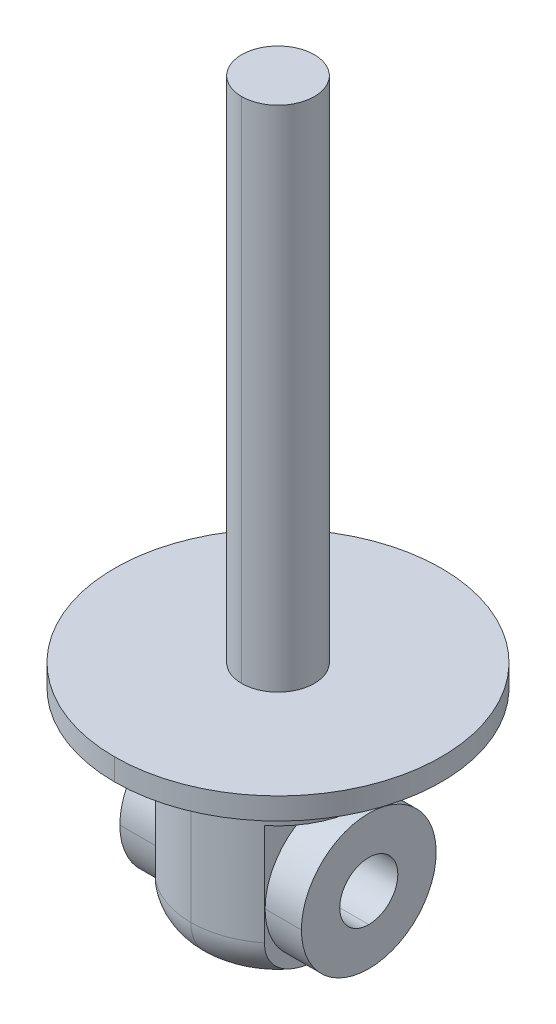
ISO-10303-21;
HEADER;
FILE_DESCRIPTION(('STEP AP214'),'2;1');
FILE_NAME('part.step','',(''),(''),'','','');
FILE_SCHEMA(('AUTOMOTIVE_DESIGN { 1 0 10303 214 1 1 1 1 }'));
ENDSEC;
DATA;
#1=APPLICATION_CONTEXT('core data for automotive mechanical design processes');
#2=APPLICATION_PROTOCOL_DEFINITION('international standard','automotive_design',2000,#1);
#3=PRODUCT_CONTEXT('',#1,'mechanical');
#4=PRODUCT('Part','Part','',(#3));
#5=PRODUCT_RELATED_PRODUCT_CATEGORY('part','',(#4));
#6=PRODUCT_DEFINITION_FORMATION('','',#4);
#7=PRODUCT_DEFINITION_CONTEXT('part definition',#1,'design');
#8=PRODUCT_DEFINITION('design','',#6,#7);
#9=PRODUCT_DEFINITION_SHAPE('','',#8);
#10=(LENGTH_UNIT() NAMED_UNIT(*) SI_UNIT(.MILLI.,.METRE.));
#11=(NAMED_UNIT(*) PLANE_ANGLE_UNIT() SI_UNIT($,.RADIAN.));
#12=(NAMED_UNIT(*) SI_UNIT($,.STERADIAN.) SOLID_ANGLE_UNIT());
#13=UNCERTAINTY_MEASURE_WITH_UNIT(LENGTH_MEASURE(1.E-05),#10,'distance_accuracy_value','');
#14=(GEOMETRIC_REPRESENTATION_CONTEXT(3) GLOBAL_UNCERTAINTY_ASSIGNED_CONTEXT((#13)) GLOBAL_UNIT_ASSIGNED_CONTEXT((#10,
#11,#12)) REPRESENTATION_CONTEXT('',''));
#15=CARTESIAN_POINT('',(0.,0.,0.));
#16=DIRECTION('',(0.,0.,1.));
#17=DIRECTION('',(1.,0.,0.));
#18=AXIS2_PLACEMENT_3D('',#15,#16,#17);
#19=CARTESIAN_POINT('',(12.5,-18.,0.));
#20=DIRECTION('',(1.,0.,0.));
#21=DIRECTION('',(0.,1.,0.));
#22=AXIS2_PLACEMENT_3D('',#19,#20,#21);
#23=PLANE('',#22);
#24=CARTESIAN_POINT('',(12.5,-18.,0.));
#25=DIRECTION('',(1.,0.,0.));
#26=DIRECTION('',(0.,0.,-1.));
#27=AXIS2_PLACEMENT_3D('',#24,#25,#26);
#28=CIRCLE('',#27,4.);
#29=CARTESIAN_POINT('',(12.5,-14.,0.));
#30=VERTEX_POINT('',#29);
#31=CARTESIAN_POINT('',(12.5,-22.,0.));
#32=VERTEX_POINT('',#31);
#33=EDGE_CURVE('E33',#30,#32,#28,.T.);
#34=ORIENTED_EDGE('',*,*,#33,.F.);
#35=CARTESIAN_POINT('',(12.5,-18.,0.));
#36=DIRECTION('',(1.,0.,0.));
#37=DIRECTION('',(0.,0.,-1.));
#38=AXIS2_PLACEMENT_3D('',#35,#36,#37);
#39=CIRCLE('',#38,4.);
#40=EDGE_CURVE('E342',#32,#30,#39,.T.);
#41=ORIENTED_EDGE('',*,*,#40,.F.);
#42=EDGE_LOOP('',(#34,#41));
#43=FACE_BOUND('',#42,.T.);
#44=CARTESIAN_POINT('',(12.5,-18.,0.));
#45=DIRECTION('',(1.,0.,0.));
#46=DIRECTION('',(0.,0.,-1.));
#47=AXIS2_PLACEMENT_3D('',#44,#45,#46);
#48=CIRCLE('',#47,9.27822291982509);
#49=CARTESIAN_POINT('',(12.5,-18.,9.27822291982508));
#50=VERTEX_POINT('',#49);
#51=CARTESIAN_POINT('',(12.5,-18.,-9.27822291982509));
#52=VERTEX_POINT('',#51);
#53=EDGE_CURVE('E10',#50,#52,#48,.T.);
#54=ORIENTED_EDGE('',*,*,#53,.T.);
#55=CARTESIAN_POINT('',(12.5,-18.,0.));
#56=DIRECTION('',(1.,0.,0.));
#57=DIRECTION('',(0.,0.,-1.));
#58=AXIS2_PLACEMENT_3D('',#55,#56,#57);
#59=CIRCLE('',#58,9.27822291982509);
#60=EDGE_CURVE('E394',#52,#50,#59,.T.);
#61=ORIENTED_EDGE('',*,*,#60,.T.);
#62=EDGE_LOOP('',(#54,#61));
#63=FACE_BOUND('',#62,.T.);
#64=ADVANCED_FACE('F15',(#43,#63),#23,.T.);
#65=CARTESIAN_POINT('',(12.5,-18.,0.));
#66=DIRECTION('',(-1.,0.,0.));
#67=DIRECTION('',(0.,0.,1.));
#68=AXIS2_PLACEMENT_3D('',#65,#66,#67);
#69=CYLINDRICAL_SURFACE('',#68,9.27822291982509);
#70=DIRECTION('',(-1.,0.,0.));
#71=VECTOR('',#70,1.);
#72=CARTESIAN_POINT('',(12.5,-18.,-9.27822291982509));
#73=LINE('',#72,#71);
#74=CARTESIAN_POINT('',(7.5,-18.,-9.27822291982509));
#75=VERTEX_POINT('',#74);
#76=EDGE_CURVE('E347',#52,#75,#73,.T.);
#77=ORIENTED_EDGE('',*,*,#76,.F.);
#78=ORIENTED_EDGE('',*,*,#53,.F.);
#79=DIRECTION('',(-1.,0.,0.));
#80=VECTOR('',#79,1.);
#81=CARTESIAN_POINT('',(12.5,-18.,9.27822291982508));
#82=LINE('',#81,#80);
#83=CARTESIAN_POINT('',(7.5,-18.,9.27822291982508));
#84=VERTEX_POINT('',#83);
#85=EDGE_CURVE('E336',#50,#84,#82,.T.);
#86=ORIENTED_EDGE('',*,*,#85,.T.);
#87=CARTESIAN_POINT('',(7.5,-18.,0.));
#88=DIRECTION('',(1.,0.,0.));
#89=DIRECTION('',(0.,-1.,0.));
#90=AXIS2_PLACEMENT_3D('',#87,#88,#89);
#91=CIRCLE('',#90,9.27822291982509);
#92=EDGE_CURVE('E221',#84,#75,#91,.T.);
#93=ORIENTED_EDGE('',*,*,#92,.T.);
#94=EDGE_LOOP('',(#77,#78,#86,#93));
#95=FACE_BOUND('',#94,.T.);
#96=ADVANCED_FACE('F250',(#95),#69,.T.);
#97=CARTESIAN_POINT('',(-20.5,-18.,0.));
#98=DIRECTION('',(1.,0.,0.));
#99=DIRECTION('',(0.,1.,0.));
#100=AXIS2_PLACEMENT_3D('',#97,#98,#99);
#101=CYLINDRICAL_SURFACE('',#100,4.);
#102=DIRECTION('',(1.,0.,0.));
#103=VECTOR('',#102,1.);
#104=CARTESIAN_POINT('',(-20.5,-22.,0.));
#105=LINE('',#104,#103);
#106=CARTESIAN_POINT('',(-12.5,-22.,0.));
#107=VERTEX_POINT('',#106);
#108=EDGE_CURVE('E335',#107,#32,#105,.T.);
#109=ORIENTED_EDGE('',*,*,#108,.F.);
#110=CARTESIAN_POINT('',(-12.5,-18.,0.));
#111=DIRECTION('',(1.,0.,0.));
#112=DIRECTION('',(0.,0.,-1.));
#113=AXIS2_PLACEMENT_3D('',#110,#111,#112);
#114=CIRCLE('',#113,4.);
#115=CARTESIAN_POINT('',(-12.5,-14.,0.));
#116=VERTEX_POINT('',#115);
#117=EDGE_CURVE('E321',#116,#107,#114,.T.);
#118=ORIENTED_EDGE('',*,*,#117,.F.);
#119=DIRECTION('',(1.,0.,0.));
#120=VECTOR('',#119,1.);
#121=CARTESIAN_POINT('',(-20.5,-14.,0.));
#122=LINE('',#121,#120);
#123=EDGE_CURVE('E337',#116,#30,#122,.T.);
#124=ORIENTED_EDGE('',*,*,#123,.T.);
#125=ORIENTED_EDGE('',*,*,#33,.T.);
#126=EDGE_LOOP('',(#109,#118,#124,#125));
#127=FACE_BOUND('',#126,.T.);
#128=ADVANCED_FACE('F258',(#127),#101,.F.);
#129=CARTESIAN_POINT('',(-12.5,-18.,0.));
#130=DIRECTION('',(1.,0.,0.));
#131=DIRECTION('',(0.,1.,0.));
#132=AXIS2_PLACEMENT_3D('',#129,#130,#131);
#133=PLANE('',#132);
#134=ORIENTED_EDGE('',*,*,#117,.T.);
#135=CARTESIAN_POINT('',(-12.5,-18.,0.));
#136=DIRECTION('',(1.,0.,0.));
#137=DIRECTION('',(0.,0.,-1.));
#138=AXIS2_PLACEMENT_3D('',#135,#136,#137);
#139=CIRCLE('',#138,4.);
#140=EDGE_CURVE('E331',#107,#116,#139,.T.);
#141=ORIENTED_EDGE('',*,*,#140,.T.);
#142=EDGE_LOOP('',(#134,#141));
#143=FACE_BOUND('',#142,.T.);
#144=CARTESIAN_POINT('',(-12.5,-18.,0.));
#145=DIRECTION('',(1.,0.,0.));
#146=DIRECTION('',(0.,0.,-1.));
#147=AXIS2_PLACEMENT_3D('',#144,#145,#146);
#148=CIRCLE('',#147,9.27822291982509);
#149=CARTESIAN_POINT('',(-12.5,-18.,9.27822291982508));
#150=VERTEX_POINT('',#149);
#151=CARTESIAN_POINT('',(-12.5,-18.,-9.27822291982509));
#152=VERTEX_POINT('',#151);
#153=EDGE_CURVE('E325',#150,#152,#148,.T.);
#154=ORIENTED_EDGE('',*,*,#153,.F.);
#155=CARTESIAN_POINT('',(-12.5,-18.,0.));
#156=DIRECTION('',(1.,0.,0.));
#157=DIRECTION('',(0.,0.,-1.));
#158=AXIS2_PLACEMENT_3D('',#155,#156,#157);
#159=CIRCLE('',#158,9.27822291982509);
#160=EDGE_CURVE('E201',#152,#150,#159,.T.);
#161=ORIENTED_EDGE('',*,*,#160,.F.);
#162=EDGE_LOOP('',(#154,#161));
#163=FACE_BOUND('',#162,.T.);
#164=ADVANCED_FACE('F256',(#143,#163),#133,.F.);
#165=CARTESIAN_POINT('',(12.5,-18.,0.));
#166=DIRECTION('',(-1.,0.,0.));
#167=DIRECTION('',(0.,0.,1.));
#168=AXIS2_PLACEMENT_3D('',#165,#166,#167);
#169=CYLINDRICAL_SURFACE('',#168,9.27822291982509);
#170=DIRECTION('',(-1.,0.,0.));
#171=VECTOR('',#170,1.);
#172=CARTESIAN_POINT('',(12.5,-18.,-9.27822291982509));
#173=LINE('',#172,#171);
#174=CARTESIAN_POINT('',(-7.5,-18.,-9.27822291982509));
#175=VERTEX_POINT('',#174);
#176=EDGE_CURVE('E350',#175,#152,#173,.T.);
#177=ORIENTED_EDGE('',*,*,#176,.F.);
#178=CARTESIAN_POINT('',(-7.5,-18.,0.));
#179=DIRECTION('',(-1.,0.,0.));
#180=DIRECTION('',(0.,1.,0.));
#181=AXIS2_PLACEMENT_3D('',#178,#179,#180);
#182=CIRCLE('',#181,9.27822291982509);
#183=CARTESIAN_POINT('',(-7.5,-18.,9.27822291982508));
#184=VERTEX_POINT('',#183);
#185=EDGE_CURVE('E312',#175,#184,#182,.T.);
#186=ORIENTED_EDGE('',*,*,#185,.T.);
#187=DIRECTION('',(-1.,0.,0.));
#188=VECTOR('',#187,1.);
#189=CARTESIAN_POINT('',(12.5,-18.,9.27822291982508));
#190=LINE('',#189,#188);
#191=EDGE_CURVE('E191',#184,#150,#190,.T.);
#192=ORIENTED_EDGE('',*,*,#191,.T.);
#193=ORIENTED_EDGE('',*,*,#153,.T.);
#194=EDGE_LOOP('',(#177,#186,#192,#193));
#195=FACE_BOUND('',#194,.T.);
#196=ADVANCED_FACE('F238',(#195),#169,.T.);
#197=CARTESIAN_POINT('',(-27.5,-8.,-22.5));
#198=DIRECTION('',(0.,1.,0.));
#199=DIRECTION('',(1.,0.,0.));
#200=AXIS2_PLACEMENT_3D('',#197,#198,#199);
#201=PLANE('',#200);
#202=DIRECTION('',(0.,0.,1.));
#203=VECTOR('',#202,1.);
#204=CARTESIAN_POINT('',(-7.5,-8.,-22.5));
#205=LINE('',#204,#203);
#206=CARTESIAN_POINT('',(-7.5,-8.,-9.36749699759761));
#207=VERTEX_POINT('',#206);
#208=CARTESIAN_POINT('',(-7.5,-8.,9.36749699759759));
#209=VERTEX_POINT('',#208);
#210=EDGE_CURVE('E386',#207,#209,#205,.T.);
#211=ORIENTED_EDGE('',*,*,#210,.T.);
#212=CARTESIAN_POINT('',(0.,-8.,0.));
#213=DIRECTION('',(0.,1.,0.));
#214=DIRECTION('',(-1.,0.,0.));
#215=AXIS2_PLACEMENT_3D('',#212,#213,#214);
#216=CIRCLE('',#215,12.);
#217=EDGE_CURVE('E47',#207,#209,#216,.T.);
#218=ORIENTED_EDGE('',*,*,#217,.F.);
#219=EDGE_LOOP('',(#211,#218));
#220=FACE_BOUND('',#219,.T.);
#221=ADVANCED_FACE('F234',(#220),#201,.F.);
#222=CARTESIAN_POINT('',(27.5,-8.,-22.5));
#223=DIRECTION('',(0.,1.,0.));
#224=DIRECTION('',(1.,0.,0.));
#225=AXIS2_PLACEMENT_3D('',#222,#223,#224);
#226=PLANE('',#225);
#227=DIRECTION('',(0.,0.,1.));
#228=VECTOR('',#227,1.);
#229=CARTESIAN_POINT('',(7.5,-8.,-22.5));
#230=LINE('',#229,#228);
#231=CARTESIAN_POINT('',(7.5,-8.,-9.3674969975976));
#232=VERTEX_POINT('',#231);
#233=CARTESIAN_POINT('',(7.5,-8.,9.3674969975976));
#234=VERTEX_POINT('',#233);
#235=EDGE_CURVE('E165',#232,#234,#230,.T.);
#236=ORIENTED_EDGE('',*,*,#235,.F.);
#237=CARTESIAN_POINT('',(0.,-8.,0.));
#238=DIRECTION('',(0.,1.,0.));
#239=DIRECTION('',(-1.,0.,0.));
#240=AXIS2_PLACEMENT_3D('',#237,#238,#239);
#241=CIRCLE('',#240,12.);
#242=EDGE_CURVE('E171',#234,#232,#241,.T.);
#243=ORIENTED_EDGE('',*,*,#242,.F.);
#244=EDGE_LOOP('',(#236,#243));
#245=FACE_BOUND('',#244,.T.);
#246=ADVANCED_FACE('F228',(#245),#226,.F.);
#247=CARTESIAN_POINT('',(0.,-22.,0.));
#248=DIRECTION('',(0.,-1.,0.));
#249=DIRECTION('',(0.,0.,-1.));
#250=AXIS2_PLACEMENT_3D('',#247,#248,#249);
#251=DEGENERATE_TOROIDAL_SURFACE('',#250,6.,6.,.T.);
#252=CARTESIAN_POINT('',(0.,-22.,6.));
#253=DIRECTION('',(1.,0.,0.));
#254=DIRECTION('',(0.,0.,-1.));
#255=AXIS2_PLACEMENT_3D('',#252,#253,#254);
#256=CIRCLE('',#255,6.);
#257=CARTESIAN_POINT('',(0.,-22.,12.));
#258=VERTEX_POINT('',#257);
#259=CARTESIAN_POINT('',(0.,-28.,6.));
#260=VERTEX_POINT('',#259);
#261=EDGE_CURVE('E190',#258,#260,#256,.T.);
#262=ORIENTED_EDGE('',*,*,#261,.F.);
#263=CARTESIAN_POINT('',(0.,-22.,0.));
#264=DIRECTION('',(0.,1.,0.));
#265=DIRECTION('',(0.,0.,-1.));
#266=AXIS2_PLACEMENT_3D('',#263,#264,#265);
#267=CIRCLE('',#266,12.);
#268=CARTESIAN_POINT('',(-7.5,-22.,9.3674969975976));
#269=VERTEX_POINT('',#268);
#270=EDGE_CURVE('E384',#269,#258,#267,.T.);
#271=ORIENTED_EDGE('',*,*,#270,.F.);
#272=CARTESIAN_POINT('',(-7.5,-22.,-9.3674969975976));
#273=CARTESIAN_POINT('',(-7.5,-22.1379254134121,-9.36752360059183));
#274=CARTESIAN_POINT('',(-7.5,-22.2758424204656,-9.36140588140784));
#275=CARTESIAN_POINT('',(-7.5,-22.550567682157,-9.33707750948176));
#276=CARTESIAN_POINT('',(-7.5,-22.687376240306,-9.31887028868478));
#277=CARTESIAN_POINT('',(-7.5,-22.9582958946312,-9.27066096029671));
#278=CARTESIAN_POINT('',(-7.5,-23.0924159761173,-9.24070924914176));
#279=CARTESIAN_POINT('',(-7.5,-23.3575801130501,-9.16937353046772));
#280=CARTESIAN_POINT('',(-7.5,-23.4886240768744,-9.12798918289375));
#281=CARTESIAN_POINT('',(-7.5,-23.7466218966691,-9.03430487179111));
#282=CARTESIAN_POINT('',(-7.5,-23.8735790248543,-8.98201390514934));
#283=CARTESIAN_POINT('',(-7.5,-24.1227575760699,-8.86705796751639));
#284=CARTESIAN_POINT('',(-7.5,-24.2449771613871,-8.80438901958829));
#285=CARTESIAN_POINT('',(-7.5,-24.4839677765168,-8.66933878779964));
#286=CARTESIAN_POINT('',(-7.5,-24.600737113538,-8.59695451315764));
#287=CARTESIAN_POINT('',(-7.5,-24.8282482206916,-8.44319283050263));
#288=CARTESIAN_POINT('',(-7.5,-24.9389877097997,-8.36181205400793));
#289=CARTESIAN_POINT('',(-7.5,-25.1579144187622,-8.18768643874841));
#290=CARTESIAN_POINT('',(-7.5,-25.2658555443986,-8.0946325111893));
#291=CARTESIAN_POINT('',(-7.5,-25.4743801275468,-7.90055755028191));
#292=CARTESIAN_POINT('',(-7.5,-25.574960718531,-7.79953344447683));
#293=CARTESIAN_POINT('',(-7.5,-25.7684584054089,-7.59046390999482));
#294=CARTESIAN_POINT('',(-7.5,-25.8613778354865,-7.48242063797192));
#295=CARTESIAN_POINT('',(-7.5,-26.0394979594376,-7.26013734848887));
#296=CARTESIAN_POINT('',(-7.5,-26.1246970382165,-7.14589604235709));
#297=CARTESIAN_POINT('',(-7.5,-26.3256362297516,-6.85704785260765));
#298=CARTESIAN_POINT('',(-7.5,-26.436902438093,-6.67931237369057));
#299=CARTESIAN_POINT('',(-7.5,-26.6432107364478,-6.31464956725694));
#300=CARTESIAN_POINT('',(-7.5,-26.7382457590837,-6.12771828110244));
#301=CARTESIAN_POINT('',(-7.5,-26.9130469720023,-5.74657680556301));
#302=CARTESIAN_POINT('',(-7.5,-26.9927921722833,-5.55235704142313));
#303=CARTESIAN_POINT('',(-7.5,-27.1380510486321,-5.15863813842682));
#304=CARTESIAN_POINT('',(-7.5,-27.2035584073192,-4.95913669993503));
#305=CARTESIAN_POINT('',(-7.5,-27.3908167563932,-4.32075112994489));
#306=CARTESIAN_POINT('',(-7.5,-27.488737771845,-3.87479771114662));
#307=CARTESIAN_POINT('',(-7.5,-27.6017957498453,-3.20049867939429));
#308=CARTESIAN_POINT('',(-7.5,-27.6338621024577,-2.97457033501139));
#309=CARTESIAN_POINT('',(-7.5,-27.6885822962053,-2.52153437146821));
#310=CARTESIAN_POINT('',(-7.5,-27.7112360361744,-2.29442673965958));
#311=CARTESIAN_POINT('',(-7.5,-27.7489050077237,-1.83797472165514));
#312=CARTESIAN_POINT('',(-7.5,-27.7638643279914,-1.60862597054498));
#313=CARTESIAN_POINT('',(-7.5,-27.7872326513197,-1.14960042693193));
#314=CARTESIAN_POINT('',(-7.5,-27.795641641953,-0.919923633807492));
#315=CARTESIAN_POINT('',(-7.5,-27.8067543785877,-0.460639935174112));
#316=CARTESIAN_POINT('',(-7.5,-27.8094631170701,-0.231033144758664));
#317=CARTESIAN_POINT('',(-7.5,-27.8094868514051,0.228176494663475));
#318=CARTESIAN_POINT('',(-7.5,-27.8068019934575,0.457779343608303));
#319=CARTESIAN_POINT('',(-7.5,-27.797106299199,0.860050901628305));
#320=CARTESIAN_POINT('',(-7.5,-27.7913302604078,1.03274967497372));
#321=CARTESIAN_POINT('',(-7.5,-27.7762113914314,1.37799585794137));
#322=CARTESIAN_POINT('',(-7.5,-27.7668685211352,1.55054326583954));
#323=CARTESIAN_POINT('',(-7.5,-27.7441222445644,1.89543395854636));
#324=CARTESIAN_POINT('',(-7.5,-27.7307175080893,2.06777715789017));
#325=CARTESIAN_POINT('',(-7.5,-27.6992162328472,2.41203319676412));
#326=CARTESIAN_POINT('',(-7.5,-27.6811196339046,2.58394603074606));
#327=CARTESIAN_POINT('',(-7.5,-27.6189984072914,3.09633927873998));
#328=CARTESIAN_POINT('',(-7.5,-27.5670008025708,3.43591849549255));
#329=CARTESIAN_POINT('',(-7.5,-27.4351439450301,4.10958563941368));
#330=CARTESIAN_POINT('',(-7.5,-27.3553094327879,4.44367816780466));
#331=CARTESIAN_POINT('',(-7.5,-27.2038094114319,4.9571593885105));
#332=CARTESIAN_POINT('',(-7.5,-27.1439572159145,5.14004569930575));
#333=CARTESIAN_POINT('',(-7.5,-27.0123545724249,5.50146198941905));
#334=CARTESIAN_POINT('',(-7.5,-26.9406080329527,5.67999337773736));
#335=CARTESIAN_POINT('',(-7.5,-26.7842301313357,6.031489322708));
#336=CARTESIAN_POINT('',(-7.5,-26.6995905503935,6.20445024260161));
#337=CARTESIAN_POINT('',(-7.5,-26.5167435994698,6.5430641087));
#338=CARTESIAN_POINT('',(-7.5,-26.4185383392775,6.70871818601919));
#339=CARTESIAN_POINT('',(-7.5,-26.2240628549029,7.00648456258087));
#340=CARTESIAN_POINT('',(-7.5,-26.1297526217824,7.1398768355879));
#341=CARTESIAN_POINT('',(-7.5,-25.9309717508643,7.3988564002536));
#342=CARTESIAN_POINT('',(-7.5,-25.8265029728894,7.52444511371039));
#343=CARTESIAN_POINT('',(-7.5,-25.6075181829435,7.7665314966958));
#344=CARTESIAN_POINT('',(-7.5,-25.4930034437946,7.88303031438931));
#345=CARTESIAN_POINT('',(-7.5,-25.2542487234706,8.10562377604684));
#346=CARTESIAN_POINT('',(-7.5,-25.1300087847672,8.21171846544314));
#347=CARTESIAN_POINT('',(-7.5,-24.8712831578792,8.41301944669364));
#348=CARTESIAN_POINT('',(-7.5,-24.7367197576334,8.50812614601197));
#349=CARTESIAN_POINT('',(-7.5,-24.4591431005642,8.6850713268851));
#350=CARTESIAN_POINT('',(-7.5,-24.3161309810273,8.76691158871438));
#351=CARTESIAN_POINT('',(-7.5,-24.0228672605758,8.91604550688865));
#352=CARTESIAN_POINT('',(-7.5,-23.8726230469065,8.98335363708052));
#353=CARTESIAN_POINT('',(-7.5,-23.5661886074975,9.10243797358141));
#354=CARTESIAN_POINT('',(-7.5,-23.4100007269355,9.1542202357345));
#355=CARTESIAN_POINT('',(-7.5,-23.048005693321,9.25381951998555));
#356=CARTESIAN_POINT('',(-7.5,-22.8406965080918,9.29634039675817));
#357=CARTESIAN_POINT('',(-7.5,-22.5269831405923,9.33897128720725));
#358=CARTESIAN_POINT('',(-7.5,-22.4219062040902,9.34965655393754));
#359=CARTESIAN_POINT('',(-7.5,-22.2112321785035,9.3639211959821));
#360=CARTESIAN_POINT('',(-7.5,-22.1056349112544,9.36749793915783));
#361=CARTESIAN_POINT('',(-7.5,-22.,9.3674969975976));
#362=B_SPLINE_CURVE_WITH_KNOTS('',3,(#272,#273,#274,#275,#276,#277,#278,#279,#280,#281,#282,
#283,#284,#285,#286,#287,#288,#289,#290,#291,#292,#293,#294,#295,#296,#297,#298,#299,#300,#301,
#302,#303,#304,#305,#306,#307,#308,#309,#310,#311,#312,#313,#314,#315,#316,#317,#318,#319,#320,
#321,#322,#323,#324,#325,#326,#327,#328,#329,#330,#331,#332,#333,#334,#335,#336,#337,#338,#339,
#340,#341,#342,#343,#344,#345,#346,#347,#348,#349,#350,#351,#352,#353,#354,#355,#356,#357,#358,
#359,#360,#361),.UNSPECIFIED.,.F.,.F.,(4,2,2,2,2,2,2,2,2,2,2,2,2,2,2,2,2,2,2,2,2,2,2,2,2,2,2,2,
2,2,2,2,2,2,2,2,2,2,2,2,2,2,2,2,4),(0.,0.41362766095782,0.82713795224049,1.23889292531047,
1.65066014703046,2.06208903526022,2.47367595318575,2.88538986653019,3.29725845980358,
3.72436840968128,4.15164382008326,4.57878856445534,5.00602246204292,5.63412279017243,
6.26249591213936,6.89172558882265,7.52123388954821,8.88702034085291,9.57151531796762,
10.2560176518047,10.9454260281894,11.6348357125137,12.3236413359055,13.0124282886643,
13.5307826706529,14.0491428819969,14.5676730323729,15.086209833487,16.1159504747561,
17.1447782375759,17.7217227524581,18.2984780568892,18.875602570301,19.4526374278272,
19.9422698137432,20.4318127261109,20.9212937027868,21.4107725419238,21.9043878690428,
22.3979369010797,22.8909920724463,23.3838546773681,24.0165937648422,24.333246308628,
24.6500160804414),.UNSPECIFIED.);
#363=CARTESIAN_POINT('',(-7.5,-22.,-9.3674969975976));
#364=VERTEX_POINT('',#363);
#365=EDGE_CURVE('E212',#364,#269,#362,.T.);
#366=ORIENTED_EDGE('',*,*,#365,.F.);
#367=CARTESIAN_POINT('',(0.,-22.,0.));
#368=DIRECTION('',(0.,1.,0.));
#369=DIRECTION('',(0.,0.,-1.));
#370=AXIS2_PLACEMENT_3D('',#367,#368,#369);
#371=CIRCLE('',#370,12.);
#372=CARTESIAN_POINT('',(0.,-22.,-12.));
#373=VERTEX_POINT('',#372);
#374=EDGE_CURVE('E385',#373,#364,#371,.T.);
#375=ORIENTED_EDGE('',*,*,#374,.F.);
#376=CARTESIAN_POINT('',(0.,-22.,-6.));
#377=DIRECTION('',(-1.,0.,0.));
#378=DIRECTION('',(0.,0.,1.));
#379=AXIS2_PLACEMENT_3D('',#376,#377,#378);
#380=CIRCLE('',#379,6.);
#381=CARTESIAN_POINT('',(0.,-28.,-6.));
#382=VERTEX_POINT('',#381);
#383=EDGE_CURVE('E211',#373,#382,#380,.T.);
#384=ORIENTED_EDGE('',*,*,#383,.T.);
#385=CARTESIAN_POINT('',(0.,-28.,0.));
#386=DIRECTION('',(0.,-1.,0.));
#387=DIRECTION('',(0.,0.,-1.));
#388=AXIS2_PLACEMENT_3D('',#385,#386,#387);
#389=CIRCLE('',#388,6.);
#390=EDGE_CURVE('E407',#260,#382,#389,.T.);
#391=ORIENTED_EDGE('',*,*,#390,.F.);
#392=EDGE_LOOP('',(#262,#271,#366,#375,#384,#391));
#393=FACE_BOUND('',#392,.T.);
#394=ADVANCED_FACE('F222',(#393),#251,.T.);
#395=CARTESIAN_POINT('',(0.,-28.,0.));
#396=DIRECTION('',(0.,-1.,0.));
#397=DIRECTION('',(0.,0.,-1.));
#398=AXIS2_PLACEMENT_3D('',#395,#396,#397);
#399=PLANE('',#398);
#400=CARTESIAN_POINT('',(0.,-28.,0.));
#401=DIRECTION('',(0.,-1.,0.));
#402=DIRECTION('',(0.,0.,-1.));
#403=AXIS2_PLACEMENT_3D('',#400,#401,#402);
#404=CIRCLE('',#403,6.);
#405=EDGE_CURVE('E198',#382,#260,#404,.T.);
#406=ORIENTED_EDGE('',*,*,#405,.T.);
#407=ORIENTED_EDGE('',*,*,#390,.T.);
#408=EDGE_LOOP('',(#406,#407));
#409=FACE_BOUND('',#408,.T.);
#410=ADVANCED_FACE('F227',(#409),#399,.T.);
#411=CARTESIAN_POINT('',(0.,-28.,0.));
#412=DIRECTION('',(0.,1.,0.));
#413=DIRECTION('',(0.,0.,1.));
#414=AXIS2_PLACEMENT_3D('',#411,#412,#413);
#415=CYLINDRICAL_SURFACE('',#414,12.);
#416=DIRECTION('',(0.,1.,0.));
#417=VECTOR('',#416,1.);
#418=CARTESIAN_POINT('',(0.,-28.,-12.));
#419=LINE('',#418,#417);
#420=CARTESIAN_POINT('',(0.,0.,-12.));
#421=VERTEX_POINT('',#420);
#422=EDGE_CURVE('E183',#373,#421,#419,.T.);
#423=ORIENTED_EDGE('',*,*,#422,.F.);
#424=ORIENTED_EDGE('',*,*,#374,.T.);
#425=DIRECTION('',(0.,1.,0.));
#426=VECTOR('',#425,1.);
#427=CARTESIAN_POINT('',(-7.5,-28.,-9.3674969975976));
#428=LINE('',#427,#426);
#429=EDGE_CURVE('E315',#364,#207,#428,.T.);
#430=ORIENTED_EDGE('',*,*,#429,.T.);
#431=ORIENTED_EDGE('',*,*,#217,.T.);
#432=DIRECTION('',(0.,-1.,0.));
#433=VECTOR('',#432,1.);
#434=CARTESIAN_POINT('',(-7.5,-28.,9.3674969975976));
#435=LINE('',#434,#433);
#436=EDGE_CURVE('E220',#209,#269,#435,.T.);
#437=ORIENTED_EDGE('',*,*,#436,.T.);
#438=ORIENTED_EDGE('',*,*,#270,.T.);
#439=DIRECTION('',(0.,1.,0.));
#440=VECTOR('',#439,1.);
#441=CARTESIAN_POINT('',(0.,-28.,12.));
#442=LINE('',#441,#440);
#443=CARTESIAN_POINT('',(0.,0.,12.));
#444=VERTEX_POINT('',#443);
#445=EDGE_CURVE('E172',#258,#444,#442,.T.);
#446=ORIENTED_EDGE('',*,*,#445,.T.);
#447=CARTESIAN_POINT('',(0.,0.,0.));
#448=DIRECTION('',(0.,-1.,0.));
#449=DIRECTION('',(0.,0.,1.));
#450=AXIS2_PLACEMENT_3D('',#447,#448,#449);
#451=CIRCLE('',#450,12.);
#452=EDGE_CURVE('E276',#444,#421,#451,.T.);
#453=ORIENTED_EDGE('',*,*,#452,.T.);
#454=EDGE_LOOP('',(#423,#424,#430,#431,#437,#438,#446,#453));
#455=FACE_BOUND('',#454,.T.);
#456=ADVANCED_FACE('F244',(#455),#415,.T.);
#457=CARTESIAN_POINT('',(0.,73.,0.));
#458=DIRECTION('',(0.,1.,0.));
#459=DIRECTION('',(1.,0.,0.));
#460=AXIS2_PLACEMENT_3D('',#457,#458,#459);
#461=PLANE('',#460);
#462=CARTESIAN_POINT('',(0.,73.,0.));
#463=DIRECTION('',(0.,1.,0.));
#464=DIRECTION('',(0.,0.,1.));
#465=AXIS2_PLACEMENT_3D('',#462,#463,#464);
#466=CIRCLE('',#465,5.);
#467=CARTESIAN_POINT('',(0.,73.,-5.));
#468=VERTEX_POINT('',#467);
#469=CARTESIAN_POINT('',(0.,73.,5.));
#470=VERTEX_POINT('',#469);
#471=EDGE_CURVE('E365',#468,#470,#466,.T.);
#472=ORIENTED_EDGE('',*,*,#471,.T.);
#473=CARTESIAN_POINT('',(0.,73.,0.));
#474=DIRECTION('',(0.,1.,0.));
#475=DIRECTION('',(0.,0.,1.));
#476=AXIS2_PLACEMENT_3D('',#473,#474,#475);
#477=CIRCLE('',#476,5.);
#478=EDGE_CURVE('E209',#470,#468,#477,.T.);
#479=ORIENTED_EDGE('',*,*,#478,.T.);
#480=EDGE_LOOP('',(#472,#479));
#481=FACE_BOUND('',#480,.T.);
#482=ADVANCED_FACE('F247',(#481),#461,.T.);
#483=CARTESIAN_POINT('',(0.,73.,0.));
#484=DIRECTION('',(0.,-1.,0.));
#485=DIRECTION('',(0.,0.,-1.));
#486=AXIS2_PLACEMENT_3D('',#483,#484,#485);
#487=CYLINDRICAL_SURFACE('',#486,5.);
#488=DIRECTION('',(0.,-1.,0.));
#489=VECTOR('',#488,1.);
#490=CARTESIAN_POINT('',(0.,73.,5.));
#491=LINE('',#490,#489);
#492=CARTESIAN_POINT('',(0.,3.,5.));
#493=VERTEX_POINT('',#492);
#494=EDGE_CURVE('E316',#470,#493,#491,.T.);
#495=ORIENTED_EDGE('',*,*,#494,.F.);
#496=ORIENTED_EDGE('',*,*,#471,.F.);
#497=DIRECTION('',(0.,-1.,0.));
#498=VECTOR('',#497,1.);
#499=CARTESIAN_POINT('',(0.,73.,-5.));
#500=LINE('',#499,#498);
#501=CARTESIAN_POINT('',(0.,3.,-5.));
#502=VERTEX_POINT('',#501);
#503=EDGE_CURVE('E368',#468,#502,#500,.T.);
#504=ORIENTED_EDGE('',*,*,#503,.T.);
#505=CARTESIAN_POINT('',(0.,3.,0.));
#506=DIRECTION('',(0.,1.,0.));
#507=DIRECTION('',(0.,0.,1.));
#508=AXIS2_PLACEMENT_3D('',#505,#506,#507);
#509=CIRCLE('',#508,5.);
#510=EDGE_CURVE('E289',#502,#493,#509,.T.);
#511=ORIENTED_EDGE('',*,*,#510,.T.);
#512=EDGE_LOOP('',(#495,#496,#504,#511));
#513=FACE_BOUND('',#512,.T.);
#514=ADVANCED_FACE('F230',(#513),#487,.T.);
#515=CARTESIAN_POINT('',(0.,0.,0.));
#516=DIRECTION('',(0.,1.,0.));
#517=DIRECTION('',(1.,0.,0.));
#518=AXIS2_PLACEMENT_3D('',#515,#516,#517);
#519=PLANE('',#518);
#520=ORIENTED_EDGE('',*,*,#452,.F.);
#521=CARTESIAN_POINT('',(0.,0.,0.));
#522=DIRECTION('',(0.,-1.,0.));
#523=DIRECTION('',(0.,0.,1.));
#524=AXIS2_PLACEMENT_3D('',#521,#522,#523);
#525=CIRCLE('',#524,12.);
#526=EDGE_CURVE('E309',#421,#444,#525,.T.);
#527=ORIENTED_EDGE('',*,*,#526,.F.);
#528=EDGE_LOOP('',(#520,#527));
#529=FACE_BOUND('',#528,.T.);
#530=CARTESIAN_POINT('',(0.,0.,0.));
#531=DIRECTION('',(0.,1.,0.));
#532=DIRECTION('',(0.,0.,1.));
#533=AXIS2_PLACEMENT_3D('',#530,#531,#532);
#534=CIRCLE('',#533,22.5);
#535=CARTESIAN_POINT('',(0.,0.,-22.5));
#536=VERTEX_POINT('',#535);
#537=CARTESIAN_POINT('',(0.,0.,22.5));
#538=VERTEX_POINT('',#537);
#539=EDGE_CURVE('E279',#536,#538,#534,.T.);
#540=ORIENTED_EDGE('',*,*,#539,.F.);
#541=CARTESIAN_POINT('',(0.,0.,0.));
#542=DIRECTION('',(0.,1.,0.));
#543=DIRECTION('',(0.,0.,1.));
#544=AXIS2_PLACEMENT_3D('',#541,#542,#543);
#545=CIRCLE('',#544,22.5);
#546=EDGE_CURVE('E282',#538,#536,#545,.T.);
#547=ORIENTED_EDGE('',*,*,#546,.F.);
#548=EDGE_LOOP('',(#540,#547));
#549=FACE_BOUND('',#548,.T.);
#550=ADVANCED_FACE('F260',(#529,#549),#519,.F.);
#551=CARTESIAN_POINT('',(0.,3.,0.));
#552=DIRECTION('',(0.,1.,0.));
#553=DIRECTION('',(1.,0.,0.));
#554=AXIS2_PLACEMENT_3D('',#551,#552,#553);
#555=PLANE('',#554);
#556=ORIENTED_EDGE('',*,*,#510,.F.);
#557=CARTESIAN_POINT('',(0.,3.,0.));
#558=DIRECTION('',(0.,1.,0.));
#559=DIRECTION('',(0.,0.,1.));
#560=AXIS2_PLACEMENT_3D('',#557,#558,#559);
#561=CIRCLE('',#560,5.);
#562=EDGE_CURVE('E320',#493,#502,#561,.T.);
#563=ORIENTED_EDGE('',*,*,#562,.F.);
#564=EDGE_LOOP('',(#556,#563));
#565=FACE_BOUND('',#564,.T.);
#566=CARTESIAN_POINT('',(0.,3.,0.));
#567=DIRECTION('',(0.,1.,0.));
#568=DIRECTION('',(0.,0.,1.));
#569=AXIS2_PLACEMENT_3D('',#566,#567,#568);
#570=CIRCLE('',#569,22.5);
#571=CARTESIAN_POINT('',(0.,3.,-22.5));
#572=VERTEX_POINT('',#571);
#573=CARTESIAN_POINT('',(0.,3.,22.5));
#574=VERTEX_POINT('',#573);
#575=EDGE_CURVE('E290',#572,#574,#570,.T.);
#576=ORIENTED_EDGE('',*,*,#575,.T.);
#577=CARTESIAN_POINT('',(0.,3.,0.));
#578=DIRECTION('',(0.,1.,0.));
#579=DIRECTION('',(0.,0.,1.));
#580=AXIS2_PLACEMENT_3D('',#577,#578,#579);
#581=CIRCLE('',#580,22.5);
#582=EDGE_CURVE('E306',#574,#572,#581,.T.);
#583=ORIENTED_EDGE('',*,*,#582,.T.);
#584=EDGE_LOOP('',(#576,#583));
#585=FACE_BOUND('',#584,.T.);
#586=ADVANCED_FACE('F262',(#565,#585),#555,.T.);
#587=CARTESIAN_POINT('',(0.,3.,0.));
#588=DIRECTION('',(0.,-1.,0.));
#589=DIRECTION('',(0.,0.,-1.));
#590=AXIS2_PLACEMENT_3D('',#587,#588,#589);
#591=CYLINDRICAL_SURFACE('',#590,22.5);
#592=DIRECTION('',(0.,-1.,0.));
#593=VECTOR('',#592,1.);
#594=CARTESIAN_POINT('',(0.,3.,22.5));
#595=LINE('',#594,#593);
#596=EDGE_CURVE('E300',#574,#538,#595,.T.);
#597=ORIENTED_EDGE('',*,*,#596,.F.);
#598=ORIENTED_EDGE('',*,*,#575,.F.);
#599=DIRECTION('',(0.,-1.,0.));
#600=VECTOR('',#599,1.);
#601=CARTESIAN_POINT('',(0.,3.,-22.5));
#602=LINE('',#601,#600);
#603=EDGE_CURVE('E293',#572,#536,#602,.T.);
#604=ORIENTED_EDGE('',*,*,#603,.T.);
#605=ORIENTED_EDGE('',*,*,#539,.T.);
#606=EDGE_LOOP('',(#597,#598,#604,#605));
#607=FACE_BOUND('',#606,.T.);
#608=ADVANCED_FACE('F269',(#607),#591,.T.);
#609=CARTESIAN_POINT('',(-7.5,-8.,-22.5));
#610=DIRECTION('',(1.,0.,0.));
#611=DIRECTION('',(0.,1.,0.));
#612=AXIS2_PLACEMENT_3D('',#609,#610,#611);
#613=PLANE('',#612);
#614=CARTESIAN_POINT('',(-7.5,-18.,0.));
#615=DIRECTION('',(-1.,0.,0.));
#616=DIRECTION('',(0.,1.,0.));
#617=AXIS2_PLACEMENT_3D('',#614,#615,#616);
#618=CIRCLE('',#617,9.27822291982509);
#619=EDGE_CURVE('E341',#184,#175,#618,.T.);
#620=ORIENTED_EDGE('',*,*,#619,.F.);
#621=ORIENTED_EDGE('',*,*,#185,.F.);
#622=EDGE_LOOP('',(#620,#621));
#623=FACE_BOUND('',#622,.T.);
#624=ORIENTED_EDGE('',*,*,#365,.T.);
#625=ORIENTED_EDGE('',*,*,#436,.F.);
#626=ORIENTED_EDGE('',*,*,#210,.F.);
#627=ORIENTED_EDGE('',*,*,#429,.F.);
#628=EDGE_LOOP('',(#624,#625,#626,#627));
#629=FACE_BOUND('',#628,.T.);
#630=ADVANCED_FACE('F17',(#623,#629),#613,.F.);
#631=CARTESIAN_POINT('',(7.5,-8.,-22.5));
#632=DIRECTION('',(-1.,0.,0.));
#633=DIRECTION('',(0.,1.,0.));
#634=AXIS2_PLACEMENT_3D('',#631,#632,#633);
#635=PLANE('',#634);
#636=ORIENTED_EDGE('',*,*,#92,.F.);
#637=CARTESIAN_POINT('',(7.5,-18.,0.));
#638=DIRECTION('',(1.,0.,0.));
#639=DIRECTION('',(0.,-1.,0.));
#640=AXIS2_PLACEMENT_3D('',#637,#638,#639);
#641=CIRCLE('',#640,9.27822291982509);
#642=EDGE_CURVE('E343',#75,#84,#641,.T.);
#643=ORIENTED_EDGE('',*,*,#642,.F.);
#644=EDGE_LOOP('',(#636,#643));
#645=FACE_BOUND('',#644,.T.);
#646=CARTESIAN_POINT('',(7.5,-22.,9.3674969975976));
#647=CARTESIAN_POINT('',(7.5,-22.1379254134121,9.36752360059183));
#648=CARTESIAN_POINT('',(7.5,-22.2758424204656,9.36140588140784));
#649=CARTESIAN_POINT('',(7.5,-22.550567682157,9.33707750948176));
#650=CARTESIAN_POINT('',(7.5,-22.687376240306,9.31887028868478));
#651=CARTESIAN_POINT('',(7.5,-22.9582958946312,9.2706609602967));
#652=CARTESIAN_POINT('',(7.5,-23.0924159761173,9.24070924914176));
#653=CARTESIAN_POINT('',(7.5,-23.3575801130501,9.16937353046771));
#654=CARTESIAN_POINT('',(7.5,-23.4886240768744,9.12798918289374));
#655=CARTESIAN_POINT('',(7.5,-23.7466218966691,9.03430487179111));
#656=CARTESIAN_POINT('',(7.5,-23.8735790248543,8.98201390514934));
#657=CARTESIAN_POINT('',(7.5,-24.1227575760699,8.86705796751638));
#658=CARTESIAN_POINT('',(7.5,-24.2449771613871,8.80438901958829));
#659=CARTESIAN_POINT('',(7.5,-24.4839677765168,8.66933878779964));
#660=CARTESIAN_POINT('',(7.5,-24.600737113538,8.59695451315764));
#661=CARTESIAN_POINT('',(7.5,-24.8282482206916,8.44319283050262));
#662=CARTESIAN_POINT('',(7.5,-24.9389877097997,8.36181205400793));
#663=CARTESIAN_POINT('',(7.5,-25.1579144187622,8.1876864387484));
#664=CARTESIAN_POINT('',(7.5,-25.2658555443986,8.0946325111893));
#665=CARTESIAN_POINT('',(7.5,-25.4743801275468,7.90055755028191));
#666=CARTESIAN_POINT('',(7.5,-25.574960718531,7.79953344447683));
#667=CARTESIAN_POINT('',(7.5,-25.7684584054089,7.59046390999482));
#668=CARTESIAN_POINT('',(7.5,-25.8613778354865,7.48242063797192));
#669=CARTESIAN_POINT('',(7.5,-26.0394979594376,7.26013734848887));
#670=CARTESIAN_POINT('',(7.5,-26.1246970382165,7.14589604235709));
#671=CARTESIAN_POINT('',(7.5,-26.3256362297516,6.85704785260765));
#672=CARTESIAN_POINT('',(7.5,-26.436902438093,6.67931237369057));
#673=CARTESIAN_POINT('',(7.5,-26.6432107364478,6.31464956725694));
#674=CARTESIAN_POINT('',(7.5,-26.7382457590837,6.12771828110244));
#675=CARTESIAN_POINT('',(7.5,-26.9130469720023,5.74657680556301));
#676=CARTESIAN_POINT('',(7.5,-26.9927921722833,5.55235704142313));
#677=CARTESIAN_POINT('',(7.5,-27.1380510486321,5.15863813842682));
#678=CARTESIAN_POINT('',(7.5,-27.2035584073192,4.95913669993503));
#679=CARTESIAN_POINT('',(7.5,-27.3908167563932,4.32075112994489));
#680=CARTESIAN_POINT('',(7.5,-27.4887377718449,3.87479771114662));
#681=CARTESIAN_POINT('',(7.5,-27.6017957498453,3.20049867939429));
#682=CARTESIAN_POINT('',(7.5,-27.6338621024577,2.97457033501139));
#683=CARTESIAN_POINT('',(7.5,-27.6885822962053,2.52153437146821));
#684=CARTESIAN_POINT('',(7.5,-27.7112360361744,2.29442673965958));
#685=CARTESIAN_POINT('',(7.5,-27.7489050077237,1.83797472165514));
#686=CARTESIAN_POINT('',(7.5,-27.7638643279914,1.60862597054499));
#687=CARTESIAN_POINT('',(7.5,-27.7872326513197,1.14960042693193));
#688=CARTESIAN_POINT('',(7.5,-27.795641641953,0.919923633807498));
#689=CARTESIAN_POINT('',(7.5,-27.8067543785877,0.460639935174117));
#690=CARTESIAN_POINT('',(7.5,-27.8094631170701,0.23103314475867));
#691=CARTESIAN_POINT('',(7.5,-27.8094868514051,-0.228176494663468));
#692=CARTESIAN_POINT('',(7.5,-27.8068019934575,-0.457779343608296));
#693=CARTESIAN_POINT('',(7.5,-27.797106299199,-0.860050901628298));
#694=CARTESIAN_POINT('',(7.5,-27.7913302604078,-1.03274967497371));
#695=CARTESIAN_POINT('',(7.5,-27.7762113914314,-1.37799585794136));
#696=CARTESIAN_POINT('',(7.5,-27.7668685211352,-1.55054326583954));
#697=CARTESIAN_POINT('',(7.5,-27.7441222445644,-1.89543395854636));
#698=CARTESIAN_POINT('',(7.5,-27.7307175080893,-2.06777715789016));
#699=CARTESIAN_POINT('',(7.5,-27.6992162328472,-2.41203319676411));
#700=CARTESIAN_POINT('',(7.5,-27.6811196339046,-2.58394603074606));
#701=CARTESIAN_POINT('',(7.5,-27.6189984072914,-3.09633927873998));
#702=CARTESIAN_POINT('',(7.5,-27.5670008025708,-3.43591849549255));
#703=CARTESIAN_POINT('',(7.5,-27.4351439450301,-4.10958563941368));
#704=CARTESIAN_POINT('',(7.5,-27.3553094327879,-4.44367816780466));
#705=CARTESIAN_POINT('',(7.5,-27.2038094114319,-4.9571593885105));
#706=CARTESIAN_POINT('',(7.5,-27.1439572159145,-5.14004569930575));
#707=CARTESIAN_POINT('',(7.5,-27.0123545724249,-5.50146198941905));
#708=CARTESIAN_POINT('',(7.5,-26.9406080329527,-5.67999337773736));
#709=CARTESIAN_POINT('',(7.5,-26.7842301313357,-6.031489322708));
#710=CARTESIAN_POINT('',(7.5,-26.6995905503935,-6.20445024260161));
#711=CARTESIAN_POINT('',(7.5,-26.5167435994698,-6.5430641087));
#712=CARTESIAN_POINT('',(7.5,-26.4185383392775,-6.70871818601919));
#713=CARTESIAN_POINT('',(7.5,-26.2240628549029,-7.00648456258087));
#714=CARTESIAN_POINT('',(7.5,-26.1297526217824,-7.1398768355879));
#715=CARTESIAN_POINT('',(7.5,-25.9309717508643,-7.3988564002536));
#716=CARTESIAN_POINT('',(7.5,-25.8265029728894,-7.52444511371039));
#717=CARTESIAN_POINT('',(7.5,-25.6075181829435,-7.7665314966958));
#718=CARTESIAN_POINT('',(7.5,-25.4930034437946,-7.88303031438931));
#719=CARTESIAN_POINT('',(7.5,-25.2542487234706,-8.10562377604684));
#720=CARTESIAN_POINT('',(7.5,-25.1300087847672,-8.21171846544314));
#721=CARTESIAN_POINT('',(7.5,-24.8712831578792,-8.41301944669364));
#722=CARTESIAN_POINT('',(7.5,-24.7367197576334,-8.50812614601197));
#723=CARTESIAN_POINT('',(7.5,-24.4591431005642,-8.6850713268851));
#724=CARTESIAN_POINT('',(7.5,-24.3161309810273,-8.76691158871438));
#725=CARTESIAN_POINT('',(7.5,-24.0228672605758,-8.91604550688864));
#726=CARTESIAN_POINT('',(7.5,-23.8726230469065,-8.98335363708052));
#727=CARTESIAN_POINT('',(7.5,-23.5661886074975,-9.10243797358141));
#728=CARTESIAN_POINT('',(7.5,-23.4100007269355,-9.15422023573449));
#729=CARTESIAN_POINT('',(7.5,-23.048005693321,-9.25381951998555));
#730=CARTESIAN_POINT('',(7.5,-22.8406965080918,-9.29634039675817));
#731=CARTESIAN_POINT('',(7.5,-22.5269831405923,-9.33897128720725));
#732=CARTESIAN_POINT('',(7.5,-22.4219062040902,-9.34965655393754));
#733=CARTESIAN_POINT('',(7.5,-22.2112321785035,-9.3639211959821));
#734=CARTESIAN_POINT('',(7.5,-22.1056349112544,-9.36749793915783));
#735=CARTESIAN_POINT('',(7.5,-22.,-9.3674969975976));
#736=B_SPLINE_CURVE_WITH_KNOTS('',3,(#646,#647,#648,#649,#650,#651,#652,#653,#654,#655,#656,
#657,#658,#659,#660,#661,#662,#663,#664,#665,#666,#667,#668,#669,#670,#671,#672,#673,#674,#675,
#676,#677,#678,#679,#680,#681,#682,#683,#684,#685,#686,#687,#688,#689,#690,#691,#692,#693,#694,
#695,#696,#697,#698,#699,#700,#701,#702,#703,#704,#705,#706,#707,#708,#709,#710,#711,#712,#713,
#714,#715,#716,#717,#718,#719,#720,#721,#722,#723,#724,#725,#726,#727,#728,#729,#730,#731,#732,
#733,#734,#735),.UNSPECIFIED.,.F.,.F.,(4,2,2,2,2,2,2,2,2,2,2,2,2,2,2,2,2,2,2,2,2,2,2,2,2,2,2,2,
2,2,2,2,2,2,2,2,2,2,2,2,2,2,2,2,4),(0.,0.41362766095782,0.827137952240493,1.23889292531047,
1.65066014703046,2.06208903526022,2.47367595318576,2.8853898665302,3.29725845980358,
3.72436840968128,4.15164382008326,4.57878856445534,5.00602246204292,5.63412279017243,
6.26249591213936,6.89172558882265,7.52123388954821,8.88702034085291,9.57151531796761,
10.2560176518047,10.9454260281894,11.6348357125137,12.3236413359055,13.0124282886643,
13.5307826706529,14.0491428819969,14.5676730323728,15.086209833487,16.1159504747561,
17.1447782375759,17.7217227524581,18.2984780568892,18.875602570301,19.4526374278272,
19.9422698137432,20.4318127261109,20.9212937027868,21.4107725419238,21.9043878690428,
22.3979369010797,22.8909920724463,23.3838546773681,24.0165937648421,24.333246308628,
24.6500160804414),.UNSPECIFIED.);
#737=CARTESIAN_POINT('',(7.5,-22.,9.3674969975976));
#738=VERTEX_POINT('',#737);
#739=CARTESIAN_POINT('',(7.5,-22.,-9.3674969975976));
#740=VERTEX_POINT('',#739);
#741=EDGE_CURVE('E20',#738,#740,#736,.T.);
#742=ORIENTED_EDGE('',*,*,#741,.T.);
#743=DIRECTION('',(0.,-1.,0.));
#744=VECTOR('',#743,1.);
#745=CARTESIAN_POINT('',(7.5,-28.,-9.3674969975976));
#746=LINE('',#745,#744);
#747=EDGE_CURVE('E205',#232,#740,#746,.T.);
#748=ORIENTED_EDGE('',*,*,#747,.F.);
#749=ORIENTED_EDGE('',*,*,#235,.T.);
#750=DIRECTION('',(0.,1.,0.));
#751=VECTOR('',#750,1.);
#752=CARTESIAN_POINT('',(7.5,-28.,9.3674969975976));
#753=LINE('',#752,#751);
#754=EDGE_CURVE('E159',#738,#234,#753,.T.);
#755=ORIENTED_EDGE('',*,*,#754,.F.);
#756=EDGE_LOOP('',(#742,#748,#749,#755));
#757=FACE_BOUND('',#756,.T.);
#758=ADVANCED_FACE('F161',(#645,#757),#635,.F.);
#759=CARTESIAN_POINT('',(0.,3.,0.));
#760=DIRECTION('',(0.,-1.,0.));
#761=DIRECTION('',(0.,0.,-1.));
#762=AXIS2_PLACEMENT_3D('',#759,#760,#761);
#763=CYLINDRICAL_SURFACE('',#762,22.5);
#764=ORIENTED_EDGE('',*,*,#582,.F.);
#765=ORIENTED_EDGE('',*,*,#596,.T.);
#766=ORIENTED_EDGE('',*,*,#546,.T.);
#767=ORIENTED_EDGE('',*,*,#603,.F.);
#768=EDGE_LOOP('',(#764,#765,#766,#767));
#769=FACE_BOUND('',#768,.T.);
#770=ADVANCED_FACE('F299',(#769),#763,.T.);
#771=CARTESIAN_POINT('',(0.,73.,0.));
#772=DIRECTION('',(0.,-1.,0.));
#773=DIRECTION('',(0.,0.,-1.));
#774=AXIS2_PLACEMENT_3D('',#771,#772,#773);
#775=CYLINDRICAL_SURFACE('',#774,5.);
#776=ORIENTED_EDGE('',*,*,#478,.F.);
#777=ORIENTED_EDGE('',*,*,#494,.T.);
#778=ORIENTED_EDGE('',*,*,#562,.T.);
#779=ORIENTED_EDGE('',*,*,#503,.F.);
#780=EDGE_LOOP('',(#776,#777,#778,#779));
#781=FACE_BOUND('',#780,.T.);
#782=ADVANCED_FACE('F450',(#781),#775,.T.);
#783=CARTESIAN_POINT('',(0.,-28.,0.));
#784=DIRECTION('',(0.,1.,0.));
#785=DIRECTION('',(0.,0.,1.));
#786=AXIS2_PLACEMENT_3D('',#783,#784,#785);
#787=CYLINDRICAL_SURFACE('',#786,12.);
#788=CARTESIAN_POINT('',(0.,-22.,0.));
#789=DIRECTION('',(0.,1.,0.));
#790=DIRECTION('',(0.,0.,-1.));
#791=AXIS2_PLACEMENT_3D('',#788,#789,#790);
#792=CIRCLE('',#791,12.);
#793=EDGE_CURVE('E181',#740,#373,#792,.T.);
#794=ORIENTED_EDGE('',*,*,#793,.T.);
#795=ORIENTED_EDGE('',*,*,#422,.T.);
#796=ORIENTED_EDGE('',*,*,#526,.T.);
#797=ORIENTED_EDGE('',*,*,#445,.F.);
#798=CARTESIAN_POINT('',(0.,-22.,0.));
#799=DIRECTION('',(0.,1.,0.));
#800=DIRECTION('',(0.,0.,-1.));
#801=AXIS2_PLACEMENT_3D('',#798,#799,#800);
#802=CIRCLE('',#801,12.);
#803=EDGE_CURVE('E178',#258,#738,#802,.T.);
#804=ORIENTED_EDGE('',*,*,#803,.T.);
#805=ORIENTED_EDGE('',*,*,#754,.T.);
#806=ORIENTED_EDGE('',*,*,#242,.T.);
#807=ORIENTED_EDGE('',*,*,#747,.T.);
#808=EDGE_LOOP('',(#794,#795,#796,#797,#804,#805,#806,#807));
#809=FACE_BOUND('',#808,.T.);
#810=ADVANCED_FACE('F185',(#809),#787,.T.);
#811=CARTESIAN_POINT('',(0.,-22.,0.));
#812=DIRECTION('',(0.,-1.,0.));
#813=DIRECTION('',(0.,0.,-1.));
#814=AXIS2_PLACEMENT_3D('',#811,#812,#813);
#815=DEGENERATE_TOROIDAL_SURFACE('',#814,6.,6.,.T.);
#816=ORIENTED_EDGE('',*,*,#803,.F.);
#817=ORIENTED_EDGE('',*,*,#261,.T.);
#818=ORIENTED_EDGE('',*,*,#405,.F.);
#819=ORIENTED_EDGE('',*,*,#383,.F.);
#820=ORIENTED_EDGE('',*,*,#793,.F.);
#821=ORIENTED_EDGE('',*,*,#741,.F.);
#822=EDGE_LOOP('',(#816,#817,#818,#819,#820,#821));
#823=FACE_BOUND('',#822,.T.);
#824=ADVANCED_FACE('F176',(#823),#815,.T.);
#825=CARTESIAN_POINT('',(12.5,-18.,0.));
#826=DIRECTION('',(-1.,0.,0.));
#827=DIRECTION('',(0.,0.,1.));
#828=AXIS2_PLACEMENT_3D('',#825,#826,#827);
#829=CYLINDRICAL_SURFACE('',#828,9.27822291982509);
#830=ORIENTED_EDGE('',*,*,#619,.T.);
#831=ORIENTED_EDGE('',*,*,#176,.T.);
#832=ORIENTED_EDGE('',*,*,#160,.T.);
#833=ORIENTED_EDGE('',*,*,#191,.F.);
#834=EDGE_LOOP('',(#830,#831,#832,#833));
#835=FACE_BOUND('',#834,.T.);
#836=ADVANCED_FACE('F255',(#835),#829,.T.);
#837=CARTESIAN_POINT('',(-20.5,-18.,0.));
#838=DIRECTION('',(1.,0.,0.));
#839=DIRECTION('',(0.,1.,0.));
#840=AXIS2_PLACEMENT_3D('',#837,#838,#839);
#841=CYLINDRICAL_SURFACE('',#840,4.);
#842=ORIENTED_EDGE('',*,*,#140,.F.);
#843=ORIENTED_EDGE('',*,*,#108,.T.);
#844=ORIENTED_EDGE('',*,*,#40,.T.);
#845=ORIENTED_EDGE('',*,*,#123,.F.);
#846=EDGE_LOOP('',(#842,#843,#844,#845));
#847=FACE_BOUND('',#846,.T.);
#848=ADVANCED_FACE('F242',(#847),#841,.F.);
#849=CARTESIAN_POINT('',(12.5,-18.,0.));
#850=DIRECTION('',(-1.,0.,0.));
#851=DIRECTION('',(0.,0.,1.));
#852=AXIS2_PLACEMENT_3D('',#849,#850,#851);
#853=CYLINDRICAL_SURFACE('',#852,9.27822291982509);
#854=ORIENTED_EDGE('',*,*,#60,.F.);
#855=ORIENTED_EDGE('',*,*,#76,.T.);
#856=ORIENTED_EDGE('',*,*,#642,.T.);
#857=ORIENTED_EDGE('',*,*,#85,.F.);
#858=EDGE_LOOP('',(#854,#855,#856,#857));
#859=FACE_BOUND('',#858,.T.);
#860=ADVANCED_FACE('F239',(#859),#853,.T.);
#861=CLOSED_SHELL('',(#64,#96,#128,#164,#196,#221,#246,#394,#410,#456,#482,#514,#550,#586,#608,
#630,#758,#770,#782,#810,#824,#836,#848,#860));
#862=MANIFOLD_SOLID_BREP('B1',#861);
#863=ADVANCED_BREP_SHAPE_REPRESENTATION('',(#18,#862),#14);
#864=SHAPE_DEFINITION_REPRESENTATION(#9,#863);
ENDSEC;
END-ISO-10303-21;
